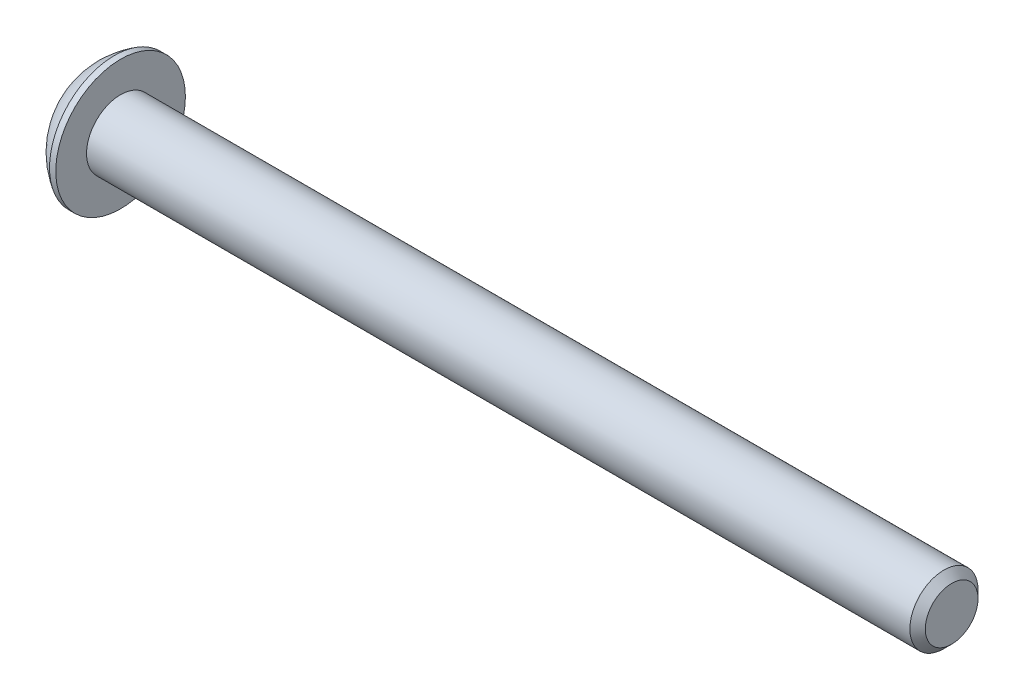
ISO-10303-21;
HEADER;
FILE_DESCRIPTION(('STEP AP214'),'2;1');
FILE_NAME('part.step','',(''),(''),'','','');
FILE_SCHEMA(('AUTOMOTIVE_DESIGN { 1 0 10303 214 1 1 1 1 }'));
ENDSEC;
DATA;
#1=APPLICATION_CONTEXT('core data for automotive mechanical design processes');
#2=APPLICATION_PROTOCOL_DEFINITION('international standard','automotive_design',2000,#1);
#3=PRODUCT_CONTEXT('',#1,'mechanical');
#4=PRODUCT('Part','Part','',(#3));
#5=PRODUCT_RELATED_PRODUCT_CATEGORY('part','',(#4));
#6=PRODUCT_DEFINITION_FORMATION('','',#4);
#7=PRODUCT_DEFINITION_CONTEXT('part definition',#1,'design');
#8=PRODUCT_DEFINITION('design','',#6,#7);
#9=PRODUCT_DEFINITION_SHAPE('','',#8);
#10=(LENGTH_UNIT() NAMED_UNIT(*) SI_UNIT(.MILLI.,.METRE.));
#11=(NAMED_UNIT(*) PLANE_ANGLE_UNIT() SI_UNIT($,.RADIAN.));
#12=(NAMED_UNIT(*) SI_UNIT($,.STERADIAN.) SOLID_ANGLE_UNIT());
#13=UNCERTAINTY_MEASURE_WITH_UNIT(LENGTH_MEASURE(1.E-05),#10,'distance_accuracy_value','');
#14=(GEOMETRIC_REPRESENTATION_CONTEXT(3) GLOBAL_UNCERTAINTY_ASSIGNED_CONTEXT((#13)) GLOBAL_UNIT_ASSIGNED_CONTEXT((#10,
#11,#12)) REPRESENTATION_CONTEXT('',''));
#15=CARTESIAN_POINT('',(0.,0.,0.));
#16=DIRECTION('',(0.,0.,1.));
#17=DIRECTION('',(1.,0.,0.));
#18=AXIS2_PLACEMENT_3D('',#15,#16,#17);
#19=CARTESIAN_POINT('',(1.32080000000034,0.,0.));
#20=DIRECTION('',(-1.,0.,0.));
#21=DIRECTION('',(0.,0.,-1.));
#22=AXIS2_PLACEMENT_3D('',#19,#20,#21);
#23=CONICAL_SURFACE('',#22,1.1937999999998,1.04719755119608);
#24=CARTESIAN_POINT('',(2.01004075135902,0.,-4.44089209850063E-13));
#25=VERTEX_POINT('',#24);
#26=VERTEX_LOOP('',#25);
#27=FACE_BOUND('',#26,.T.);
#28=CARTESIAN_POINT('',(1.32080000000009,0.,0.));
#29=DIRECTION('',(1.,0.,0.));
#30=DIRECTION('',(0.,0.,-1.));
#31=AXIS2_PLACEMENT_3D('',#28,#29,#30);
#32=CIRCLE('',#31,1.19380000000024);
#33=CARTESIAN_POINT('',(1.32080000000004,-1.03386112703797,-0.59690000000006));
#34=VERTEX_POINT('',#33);
#35=CARTESIAN_POINT('',(1.32080000000004,0.,-1.19380000000012));
#36=VERTEX_POINT('',#35);
#37=EDGE_CURVE('E37',#34,#36,#32,.T.);
#38=ORIENTED_EDGE('',*,*,#37,.F.);
#39=CARTESIAN_POINT('',(1.32080000000009,0.,0.));
#40=DIRECTION('',(1.,0.,0.));
#41=DIRECTION('',(0.,0.,-1.));
#42=AXIS2_PLACEMENT_3D('',#39,#40,#41);
#43=CIRCLE('',#42,1.19380000000024);
#44=CARTESIAN_POINT('',(1.32080000000004,-1.03386112703797,0.59690000000006));
#45=VERTEX_POINT('',#44);
#46=EDGE_CURVE('E127',#45,#34,#43,.T.);
#47=ORIENTED_EDGE('',*,*,#46,.F.);
#48=CARTESIAN_POINT('',(1.32080000000009,0.,0.));
#49=DIRECTION('',(1.,0.,0.));
#50=DIRECTION('',(0.,0.,-1.));
#51=AXIS2_PLACEMENT_3D('',#48,#49,#50);
#52=CIRCLE('',#51,1.19380000000024);
#53=CARTESIAN_POINT('',(1.32080000000004,1.49457637585666E-12,1.19380000000012));
#54=VERTEX_POINT('',#53);
#55=EDGE_CURVE('E133',#54,#45,#52,.T.);
#56=ORIENTED_EDGE('',*,*,#55,.F.);
#57=CARTESIAN_POINT('',(1.32080000000009,0.,0.));
#58=DIRECTION('',(1.,0.,0.));
#59=DIRECTION('',(0.,0.,-1.));
#60=AXIS2_PLACEMENT_3D('',#57,#58,#59);
#61=CIRCLE('',#60,1.19380000000024);
#62=CARTESIAN_POINT('',(1.32080000000004,1.03386112703797,0.596900000000061));
#63=VERTEX_POINT('',#62);
#64=EDGE_CURVE('E147',#63,#54,#61,.T.);
#65=ORIENTED_EDGE('',*,*,#64,.F.);
#66=CARTESIAN_POINT('',(1.32080000000009,0.,0.));
#67=DIRECTION('',(1.,0.,0.));
#68=DIRECTION('',(0.,0.,-1.));
#69=AXIS2_PLACEMENT_3D('',#66,#67,#68);
#70=CIRCLE('',#69,1.19380000000024);
#71=CARTESIAN_POINT('',(1.32080000000004,1.03386112703797,-0.596900000000061));
#72=VERTEX_POINT('',#71);
#73=EDGE_CURVE('E140',#72,#63,#70,.T.);
#74=ORIENTED_EDGE('',*,*,#73,.F.);
#75=CARTESIAN_POINT('',(1.32080000000009,0.,0.));
#76=DIRECTION('',(1.,0.,0.));
#77=DIRECTION('',(0.,0.,-1.));
#78=AXIS2_PLACEMENT_3D('',#75,#76,#77);
#79=CIRCLE('',#78,1.19380000000024);
#80=EDGE_CURVE('E137',#36,#72,#79,.T.);
#81=ORIENTED_EDGE('',*,*,#80,.F.);
#82=EDGE_LOOP('',(#38,#47,#56,#65,#74,#81));
#83=FACE_BOUND('',#82,.T.);
#84=ADVANCED_FACE('F34',(#27,#83),#23,.F.);
#85=CARTESIAN_POINT('',(1.3208,-2.06772225407572,1.1938));
#86=DIRECTION('',(1.,0.,0.));
#87=DIRECTION('',(0.,0.,1.));
#88=AXIS2_PLACEMENT_3D('',#85,#86,#87);
#89=PLANE('',#88);
#90=DIRECTION('',(0.,0.5,-0.866025403784439));
#91=VECTOR('',#90,1.);
#92=CARTESIAN_POINT('',(1.3208,-1.37848150271715,0.));
#93=LINE('',#92,#91);
#94=CARTESIAN_POINT('',(1.3208,-0.689240751358574,-1.1938));
#95=VERTEX_POINT('',#94);
#96=EDGE_CURVE('E109',#95,#34,#93,.F.);
#97=ORIENTED_EDGE('',*,*,#96,.T.);
#98=ORIENTED_EDGE('',*,*,#37,.T.);
#99=DIRECTION('',(0.,1.,0.));
#100=VECTOR('',#99,1.);
#101=CARTESIAN_POINT('',(1.3208,-0.689240751358574,-1.1938));
#102=LINE('',#101,#100);
#103=EDGE_CURVE('E124',#36,#95,#102,.F.);
#104=ORIENTED_EDGE('',*,*,#103,.T.);
#105=EDGE_LOOP('',(#97,#98,#104));
#106=FACE_BOUND('',#105,.T.);
#107=ADVANCED_FACE('F121',(#106),#89,.F.);
#108=CARTESIAN_POINT('',(1.3208,-2.06772225407572,1.1938));
#109=DIRECTION('',(1.,0.,0.));
#110=DIRECTION('',(0.,0.,1.));
#111=AXIS2_PLACEMENT_3D('',#108,#109,#110);
#112=PLANE('',#111);
#113=DIRECTION('',(0.,-0.5,-0.866025403784439));
#114=VECTOR('',#113,1.);
#115=CARTESIAN_POINT('',(1.3208,-0.689240751358574,1.1938));
#116=LINE('',#115,#114);
#117=CARTESIAN_POINT('',(1.3208,-1.37848150271715,0.));
#118=VERTEX_POINT('',#117);
#119=EDGE_CURVE('E129',#118,#45,#116,.F.);
#120=ORIENTED_EDGE('',*,*,#119,.T.);
#121=ORIENTED_EDGE('',*,*,#46,.T.);
#122=DIRECTION('',(0.,0.5,-0.866025403784439));
#123=VECTOR('',#122,1.);
#124=CARTESIAN_POINT('',(1.3208,-1.37848150271715,0.));
#125=LINE('',#124,#123);
#126=EDGE_CURVE('E104',#34,#118,#125,.F.);
#127=ORIENTED_EDGE('',*,*,#126,.T.);
#128=EDGE_LOOP('',(#120,#121,#127));
#129=FACE_BOUND('',#128,.T.);
#130=ADVANCED_FACE('F128',(#129),#112,.F.);
#131=CARTESIAN_POINT('',(1.3208,-2.06772225407572,1.1938));
#132=DIRECTION('',(1.,0.,0.));
#133=DIRECTION('',(0.,0.,1.));
#134=AXIS2_PLACEMENT_3D('',#131,#132,#133);
#135=PLANE('',#134);
#136=DIRECTION('',(0.,1.,0.));
#137=VECTOR('',#136,1.);
#138=CARTESIAN_POINT('',(1.3208,0.689240751358577,1.1938));
#139=LINE('',#138,#137);
#140=CARTESIAN_POINT('',(1.3208,-0.689240751358574,1.1938));
#141=VERTEX_POINT('',#140);
#142=EDGE_CURVE('E166',#141,#54,#139,.T.);
#143=ORIENTED_EDGE('',*,*,#142,.T.);
#144=ORIENTED_EDGE('',*,*,#55,.T.);
#145=DIRECTION('',(0.,-0.5,-0.866025403784439));
#146=VECTOR('',#145,1.);
#147=CARTESIAN_POINT('',(1.3208,-0.689240751358574,1.1938));
#148=LINE('',#147,#146);
#149=EDGE_CURVE('E164',#45,#141,#148,.F.);
#150=ORIENTED_EDGE('',*,*,#149,.T.);
#151=EDGE_LOOP('',(#143,#144,#150));
#152=FACE_BOUND('',#151,.T.);
#153=ADVANCED_FACE('F163',(#152),#135,.F.);
#154=CARTESIAN_POINT('',(1.3208,-2.06772225407572,1.1938));
#155=DIRECTION('',(1.,0.,0.));
#156=DIRECTION('',(0.,0.,1.));
#157=AXIS2_PLACEMENT_3D('',#154,#155,#156);
#158=PLANE('',#157);
#159=DIRECTION('',(0.,-0.5,0.866025403784439));
#160=VECTOR('',#159,1.);
#161=CARTESIAN_POINT('',(1.3208,1.37848150271715,0.));
#162=LINE('',#161,#160);
#163=CARTESIAN_POINT('',(1.3208,0.689240751358577,1.1938));
#164=VERTEX_POINT('',#163);
#165=EDGE_CURVE('E173',#164,#63,#162,.F.);
#166=ORIENTED_EDGE('',*,*,#165,.T.);
#167=ORIENTED_EDGE('',*,*,#64,.T.);
#168=DIRECTION('',(0.,1.,0.));
#169=VECTOR('',#168,1.);
#170=CARTESIAN_POINT('',(1.3208,0.689240751358577,1.1938));
#171=LINE('',#170,#169);
#172=EDGE_CURVE('E171',#54,#164,#171,.T.);
#173=ORIENTED_EDGE('',*,*,#172,.T.);
#174=EDGE_LOOP('',(#166,#167,#173));
#175=FACE_BOUND('',#174,.T.);
#176=ADVANCED_FACE('F170',(#175),#158,.F.);
#177=CARTESIAN_POINT('',(1.3208,-2.06772225407572,1.1938));
#178=DIRECTION('',(1.,0.,0.));
#179=DIRECTION('',(0.,0.,1.));
#180=AXIS2_PLACEMENT_3D('',#177,#178,#179);
#181=PLANE('',#180);
#182=DIRECTION('',(0.,0.5,0.866025403784439));
#183=VECTOR('',#182,1.);
#184=CARTESIAN_POINT('',(1.3208,0.689240751358576,-1.1938));
#185=LINE('',#184,#183);
#186=CARTESIAN_POINT('',(1.3208,1.37848150271715,0.));
#187=VERTEX_POINT('',#186);
#188=EDGE_CURVE('E184',#187,#72,#185,.F.);
#189=ORIENTED_EDGE('',*,*,#188,.T.);
#190=ORIENTED_EDGE('',*,*,#73,.T.);
#191=DIRECTION('',(0.,-0.5,0.866025403784439));
#192=VECTOR('',#191,1.);
#193=CARTESIAN_POINT('',(1.3208,1.37848150271715,0.));
#194=LINE('',#193,#192);
#195=EDGE_CURVE('E176',#63,#187,#194,.F.);
#196=ORIENTED_EDGE('',*,*,#195,.T.);
#197=EDGE_LOOP('',(#189,#190,#196));
#198=FACE_BOUND('',#197,.T.);
#199=ADVANCED_FACE('F182',(#198),#181,.F.);
#200=CARTESIAN_POINT('',(1.3208,-2.06772225407572,1.1938));
#201=DIRECTION('',(1.,0.,0.));
#202=DIRECTION('',(0.,0.,1.));
#203=AXIS2_PLACEMENT_3D('',#200,#201,#202);
#204=PLANE('',#203);
#205=DIRECTION('',(0.,1.,0.));
#206=VECTOR('',#205,1.);
#207=CARTESIAN_POINT('',(1.3208,-0.689240751358574,-1.1938));
#208=LINE('',#207,#206);
#209=CARTESIAN_POINT('',(1.3208,0.689240751358576,-1.1938));
#210=VERTEX_POINT('',#209);
#211=EDGE_CURVE('E144',#210,#36,#208,.F.);
#212=ORIENTED_EDGE('',*,*,#211,.T.);
#213=ORIENTED_EDGE('',*,*,#80,.T.);
#214=DIRECTION('',(0.,0.5,0.866025403784439));
#215=VECTOR('',#214,1.);
#216=CARTESIAN_POINT('',(1.3208,0.689240751358576,-1.1938));
#217=LINE('',#216,#215);
#218=EDGE_CURVE('E186',#72,#210,#217,.F.);
#219=ORIENTED_EDGE('',*,*,#218,.T.);
#220=EDGE_LOOP('',(#212,#213,#219));
#221=FACE_BOUND('',#220,.T.);
#222=ADVANCED_FACE('F307',(#221),#204,.F.);
#223=CARTESIAN_POINT('',(1.3208,-0.689240751358574,-1.1938));
#224=DIRECTION('',(0.,0.,1.));
#225=DIRECTION('',(0.,1.,0.));
#226=AXIS2_PLACEMENT_3D('',#223,#224,#225);
#227=PLANE('',#226);
#228=DIRECTION('',(0.,1.,0.));
#229=VECTOR('',#228,1.);
#230=CARTESIAN_POINT('',(0.,0.,-1.1938));
#231=LINE('',#230,#229);
#232=CARTESIAN_POINT('',(0.,0.689240751358577,-1.1938));
#233=VERTEX_POINT('',#232);
#234=CARTESIAN_POINT('',(0.,-0.689240751358574,-1.1938));
#235=VERTEX_POINT('',#234);
#236=EDGE_CURVE('E194',#233,#235,#231,.F.);
#237=ORIENTED_EDGE('',*,*,#236,.T.);
#238=DIRECTION('',(1.,0.,0.));
#239=VECTOR('',#238,1.);
#240=CARTESIAN_POINT('',(1.3208,-0.689240751358574,-1.1938));
#241=LINE('',#240,#239);
#242=EDGE_CURVE('E116',#235,#95,#241,.T.);
#243=ORIENTED_EDGE('',*,*,#242,.T.);
#244=ORIENTED_EDGE('',*,*,#103,.F.);
#245=ORIENTED_EDGE('',*,*,#211,.F.);
#246=DIRECTION('',(1.,0.,0.));
#247=VECTOR('',#246,1.);
#248=CARTESIAN_POINT('',(1.3208,0.689240751358576,-1.1938));
#249=LINE('',#248,#247);
#250=EDGE_CURVE('E189',#210,#233,#249,.F.);
#251=ORIENTED_EDGE('',*,*,#250,.T.);
#252=EDGE_LOOP('',(#237,#243,#244,#245,#251));
#253=FACE_BOUND('',#252,.T.);
#254=ADVANCED_FACE('F273',(#253),#227,.T.);
#255=CARTESIAN_POINT('',(1.3208,-1.37848150271715,0.));
#256=DIRECTION('',(0.,0.866025403784439,0.5));
#257=DIRECTION('',(0.,0.5,-0.866025403784439));
#258=AXIS2_PLACEMENT_3D('',#255,#256,#257);
#259=PLANE('',#258);
#260=DIRECTION('',(0.,-0.5,0.866025403784439));
#261=VECTOR('',#260,1.);
#262=CARTESIAN_POINT('',(0.,-0.689240751358574,-1.1938));
#263=LINE('',#262,#261);
#264=CARTESIAN_POINT('',(0.,-1.37848150271715,0.));
#265=VERTEX_POINT('',#264);
#266=EDGE_CURVE('E270',#235,#265,#263,.T.);
#267=ORIENTED_EDGE('',*,*,#266,.T.);
#268=DIRECTION('',(1.,0.,0.));
#269=VECTOR('',#268,1.);
#270=CARTESIAN_POINT('',(1.3208,-1.37848150271715,0.));
#271=LINE('',#270,#269);
#272=EDGE_CURVE('E111',#265,#118,#271,.T.);
#273=ORIENTED_EDGE('',*,*,#272,.T.);
#274=ORIENTED_EDGE('',*,*,#126,.F.);
#275=ORIENTED_EDGE('',*,*,#96,.F.);
#276=ORIENTED_EDGE('',*,*,#242,.F.);
#277=EDGE_LOOP('',(#267,#273,#274,#275,#276));
#278=FACE_BOUND('',#277,.T.);
#279=ADVANCED_FACE('F107',(#278),#259,.T.);
#280=CARTESIAN_POINT('',(1.3208,-0.689240751358574,1.1938));
#281=DIRECTION('',(0.,0.866025403784439,-0.5));
#282=DIRECTION('',(0.,-0.5,-0.866025403784439));
#283=AXIS2_PLACEMENT_3D('',#280,#281,#282);
#284=PLANE('',#283);
#285=DIRECTION('',(0.,0.5,0.866025403784439));
#286=VECTOR('',#285,1.);
#287=CARTESIAN_POINT('',(0.,-1.37848150271715,0.));
#288=LINE('',#287,#286);
#289=CARTESIAN_POINT('',(0.,-0.689240751358574,1.1938));
#290=VERTEX_POINT('',#289);
#291=EDGE_CURVE('E268',#265,#290,#288,.T.);
#292=ORIENTED_EDGE('',*,*,#291,.T.);
#293=DIRECTION('',(1.,0.,0.));
#294=VECTOR('',#293,1.);
#295=CARTESIAN_POINT('',(1.3208,-0.689240751358574,1.1938));
#296=LINE('',#295,#294);
#297=EDGE_CURVE('E177',#290,#141,#296,.T.);
#298=ORIENTED_EDGE('',*,*,#297,.T.);
#299=ORIENTED_EDGE('',*,*,#149,.F.);
#300=ORIENTED_EDGE('',*,*,#119,.F.);
#301=ORIENTED_EDGE('',*,*,#272,.F.);
#302=EDGE_LOOP('',(#292,#298,#299,#300,#301));
#303=FACE_BOUND('',#302,.T.);
#304=ADVANCED_FACE('F278',(#303),#284,.T.);
#305=CARTESIAN_POINT('',(1.3208,0.689240751358577,1.1938));
#306=DIRECTION('',(0.,0.,-1.));
#307=DIRECTION('',(1.,0.,0.));
#308=AXIS2_PLACEMENT_3D('',#305,#306,#307);
#309=PLANE('',#308);
#310=DIRECTION('',(0.,1.,0.));
#311=VECTOR('',#310,1.);
#312=CARTESIAN_POINT('',(0.,0.,1.1938));
#313=LINE('',#312,#311);
#314=CARTESIAN_POINT('',(0.,0.689240751358577,1.1938));
#315=VERTEX_POINT('',#314);
#316=EDGE_CURVE('E260',#290,#315,#313,.T.);
#317=ORIENTED_EDGE('',*,*,#316,.T.);
#318=DIRECTION('',(1.,0.,0.));
#319=VECTOR('',#318,1.);
#320=CARTESIAN_POINT('',(1.3208,0.689240751358577,1.1938));
#321=LINE('',#320,#319);
#322=EDGE_CURVE('E187',#315,#164,#321,.T.);
#323=ORIENTED_EDGE('',*,*,#322,.T.);
#324=ORIENTED_EDGE('',*,*,#172,.F.);
#325=ORIENTED_EDGE('',*,*,#142,.F.);
#326=ORIENTED_EDGE('',*,*,#297,.F.);
#327=EDGE_LOOP('',(#317,#323,#324,#325,#326));
#328=FACE_BOUND('',#327,.T.);
#329=ADVANCED_FACE('F280',(#328),#309,.T.);
#330=CARTESIAN_POINT('',(1.3208,1.37848150271715,0.));
#331=DIRECTION('',(0.,-0.866025403784439,-0.5));
#332=DIRECTION('',(0.,-0.5,0.866025403784439));
#333=AXIS2_PLACEMENT_3D('',#330,#331,#332);
#334=PLANE('',#333);
#335=DIRECTION('',(0.,0.5,-0.866025403784439));
#336=VECTOR('',#335,1.);
#337=CARTESIAN_POINT('',(0.,0.689240751358577,1.1938));
#338=LINE('',#337,#336);
#339=CARTESIAN_POINT('',(0.,1.37848150271715,0.));
#340=VERTEX_POINT('',#339);
#341=EDGE_CURVE('E257',#315,#340,#338,.T.);
#342=ORIENTED_EDGE('',*,*,#341,.T.);
#343=DIRECTION('',(1.,0.,0.));
#344=VECTOR('',#343,1.);
#345=CARTESIAN_POINT('',(1.3208,1.37848150271715,0.));
#346=LINE('',#345,#344);
#347=EDGE_CURVE('E202',#340,#187,#346,.T.);
#348=ORIENTED_EDGE('',*,*,#347,.T.);
#349=ORIENTED_EDGE('',*,*,#195,.F.);
#350=ORIENTED_EDGE('',*,*,#165,.F.);
#351=ORIENTED_EDGE('',*,*,#322,.F.);
#352=EDGE_LOOP('',(#342,#348,#349,#350,#351));
#353=FACE_BOUND('',#352,.T.);
#354=ADVANCED_FACE('F281',(#353),#334,.T.);
#355=CARTESIAN_POINT('',(1.3208,0.689240751358576,-1.1938));
#356=DIRECTION('',(0.,-0.866025403784439,0.5));
#357=DIRECTION('',(0.,0.5,0.866025403784439));
#358=AXIS2_PLACEMENT_3D('',#355,#356,#357);
#359=PLANE('',#358);
#360=DIRECTION('',(0.,-0.5,-0.866025403784439));
#361=VECTOR('',#360,1.);
#362=CARTESIAN_POINT('',(0.,1.37848150271715,0.));
#363=LINE('',#362,#361);
#364=EDGE_CURVE('E52',#340,#233,#363,.T.);
#365=ORIENTED_EDGE('',*,*,#364,.T.);
#366=ORIENTED_EDGE('',*,*,#250,.F.);
#367=ORIENTED_EDGE('',*,*,#218,.F.);
#368=ORIENTED_EDGE('',*,*,#188,.F.);
#369=ORIENTED_EDGE('',*,*,#347,.F.);
#370=EDGE_LOOP('',(#365,#366,#367,#368,#369));
#371=FACE_BOUND('',#370,.T.);
#372=ADVANCED_FACE('F282',(#371),#359,.T.);
#373=CARTESIAN_POINT('',(0.,0.,0.));
#374=DIRECTION('',(-1.,0.,0.));
#375=DIRECTION('',(0.,0.,-1.));
#376=AXIS2_PLACEMENT_3D('',#373,#374,#375);
#377=PLANE('',#376);
#378=ORIENTED_EDGE('',*,*,#341,.F.);
#379=ORIENTED_EDGE('',*,*,#316,.F.);
#380=ORIENTED_EDGE('',*,*,#291,.F.);
#381=ORIENTED_EDGE('',*,*,#266,.F.);
#382=ORIENTED_EDGE('',*,*,#236,.F.);
#383=ORIENTED_EDGE('',*,*,#364,.F.);
#384=EDGE_LOOP('',(#378,#379,#380,#381,#382,#383));
#385=FACE_BOUND('',#384,.T.);
#386=CARTESIAN_POINT('',(0.,1.9812,0.));
#387=CARTESIAN_POINT('',(0.,1.9811996664299,-0.0556258831179428));
#388=CARTESIAN_POINT('',(0.,1.97885520380442,-0.111261989398606));
#389=CARTESIAN_POINT('',(0.,1.96949260169541,-0.222149719830458));
#390=CARTESIAN_POINT('',(0.,1.96247308239605,-0.277401225602895));
#391=CARTESIAN_POINT('',(0.,1.94379192841038,-0.387209508139747));
#392=CARTESIAN_POINT('',(-1.85325793235264E-13,1.93212292489526,-0.441765039546365));
#393=CARTESIAN_POINT('',(1.86344214223505E-13,1.90422331175315,-0.549729449347493));
#394=CARTESIAN_POINT('',(6.94543371897454E-13,1.88798900035338,-0.603137359208869));
#395=CARTESIAN_POINT('',(1.15501975216981E-12,1.83266214476501,-0.760839131321828));
#396=CARTESIAN_POINT('',(0.,1.78690023648845,-0.862876433575429));
#397=CARTESIAN_POINT('',(0.,1.67887358150667,-1.05780719540872));
#398=CARTESIAN_POINT('',(9.54193214892627E-13,1.6166082074585,-1.15070030720801));
#399=CARTESIAN_POINT('',(5.94805591894675E-13,1.51224157140982,-1.28116890915697));
#400=CARTESIAN_POINT('',(1.63221293851378E-13,1.4755970394354,-1.32320451127026));
#401=CARTESIAN_POINT('',(-1.62196980336157E-13,1.39893832619713,-1.40400288695709));
#402=CARTESIAN_POINT('',(0.,1.35892742784698,-1.44276877695455));
#403=CARTESIAN_POINT('',(1.14362537325405E-13,1.23416504602197,-1.55382272417904));
#404=CARTESIAN_POINT('',(0.,1.14466125559859,-1.62089527952111));
#405=CARTESIAN_POINT('',(0.,0.955712144178167,-1.7390221808118));
#406=CARTESIAN_POINT('',(0.,0.856267198233564,-1.79007713076007));
#407=CARTESIAN_POINT('',(0.,0.650206345910843,-1.87477637530954));
#408=CARTESIAN_POINT('',(0.,0.543590516134855,-1.90842085586267));
#409=CARTESIAN_POINT('',(0.,0.326226155292018,-1.95733039300656));
#410=CARTESIAN_POINT('',(0.,0.21547760215793,-1.97259535144288));
#411=CARTESIAN_POINT('',(0.,-0.00701040587544633,-1.98431697865418));
#412=CARTESIAN_POINT('',(0.,-0.118749860774734,-1.98077364742917));
#413=CARTESIAN_POINT('',(0.,-0.340050178355485,-1.95497485623825));
#414=CARTESIAN_POINT('',(0.,-0.449611052668256,-1.93271949620218));
#415=CARTESIAN_POINT('',(0.,-0.663431110729174,-1.87014138774524));
#416=CARTESIAN_POINT('',(0.,-0.76769023783852,-1.82981844635272));
#417=CARTESIAN_POINT('',(0.,-0.968005760719347,-1.73219968377096));
#418=CARTESIAN_POINT('',(0.,-1.0640618469811,-1.6749032225164));
#419=CARTESIAN_POINT('',(0.,-1.19980276751283,-1.57757371205873));
#420=CARTESIAN_POINT('',(0.,-1.24366557129213,-1.54322665019466));
#421=CARTESIAN_POINT('',(0.,-1.32838995706696,-1.47093063174264));
#422=CARTESIAN_POINT('',(0.,-1.36924860178706,-1.43297823102439));
#423=CARTESIAN_POINT('',(0.,-1.48674671849223,-1.31419842051173));
#424=CARTESIAN_POINT('',(0.,-1.55842832343237,-1.22836221289311));
#425=CARTESIAN_POINT('',(0.,-1.6863396856475,-1.04586168272493));
#426=CARTESIAN_POINT('',(0.,-1.7425700302488,-0.949197771949775));
#427=CARTESIAN_POINT('',(0.,-1.8141614250401,-0.798182600298684));
#428=CARTESIAN_POINT('',(0.,-1.83591780585875,-0.74677620384779));
#429=CARTESIAN_POINT('',(0.,-1.87500754181092,-0.642341081688635));
#430=CARTESIAN_POINT('',(0.,-1.89234447645404,-0.589313708122846));
#431=CARTESIAN_POINT('',(0.,-1.92246053433555,-0.482076273028395));
#432=CARTESIAN_POINT('',(0.,-1.93524685475118,-0.42786822425751));
#433=CARTESIAN_POINT('',(0.,-1.95620937250494,-0.318578151844611));
#434=CARTESIAN_POINT('',(0.,-1.96438692958147,-0.263496390912872));
#435=CARTESIAN_POINT('',(0.,-1.97388528284653,-0.173607715038558));
#436=CARTESIAN_POINT('',(0.,-1.97662743364426,-0.138944718024998));
#437=CARTESIAN_POINT('',(0.,-1.98028489645283,-0.0695224782567002));
#438=CARTESIAN_POINT('',(0.,-1.98120020846367,-0.0347632355019631));
#439=CARTESIAN_POINT('',(0.,-1.9811996664299,0.0556258831179437));
#440=CARTESIAN_POINT('',(0.,-1.97885520380442,0.111261989398607));
#441=CARTESIAN_POINT('',(0.,-1.96949260169541,0.222149719830459));
#442=CARTESIAN_POINT('',(0.,-1.96247308239606,0.277401225602897));
#443=CARTESIAN_POINT('',(0.,-1.94379192841039,0.38720950813975));
#444=CARTESIAN_POINT('',(-1.85269749640692E-13,-1.93212292489526,0.441765039546367));
#445=CARTESIAN_POINT('',(1.86288125054388E-13,-1.90422331175315,0.549729449347495));
#446=CARTESIAN_POINT('',(6.94525090263764E-13,-1.88798900035338,0.603137359208872));
#447=CARTESIAN_POINT('',(1.15505622829081E-12,-1.83266214476501,0.760839131321831));
#448=CARTESIAN_POINT('',(0.,-1.78690023648845,0.862876433575431));
#449=CARTESIAN_POINT('',(0.,-1.67887358150667,1.05780719540872));
#450=CARTESIAN_POINT('',(9.5424881286938E-13,-1.6166082074585,1.15070030720801));
#451=CARTESIAN_POINT('',(5.94777756479239E-13,-1.51224157140982,1.28116890915698));
#452=CARTESIAN_POINT('',(1.63138949183833E-13,-1.47559703943539,1.32320451127027));
#453=CARTESIAN_POINT('',(-1.62114715061273E-13,-1.39893832619713,1.40400288695709));
#454=CARTESIAN_POINT('',(0.,-1.35892742784699,1.44276877695455));
#455=CARTESIAN_POINT('',(1.13760489124207E-13,-1.23416504602197,1.55382272417904));
#456=CARTESIAN_POINT('',(0.,-1.14466125559859,1.62089527952111));
#457=CARTESIAN_POINT('',(0.,-0.95571214417816,1.73902218081179));
#458=CARTESIAN_POINT('',(0.,-0.856267198233559,1.79007713076007));
#459=CARTESIAN_POINT('',(0.,-0.65020634591084,1.87477637530954));
#460=CARTESIAN_POINT('',(0.,-0.543590516134854,1.90842085586267));
#461=CARTESIAN_POINT('',(0.,-0.326226155292018,1.95733039300657));
#462=CARTESIAN_POINT('',(0.,-0.215477602157929,1.97259535144288));
#463=CARTESIAN_POINT('',(0.,0.00701040587544865,1.98431697865418));
#464=CARTESIAN_POINT('',(0.,0.118749860774737,1.98077364742916));
#465=CARTESIAN_POINT('',(0.,0.340050178355489,1.95497485623824));
#466=CARTESIAN_POINT('',(0.,0.44961105266826,1.93271949620218));
#467=CARTESIAN_POINT('',(0.,0.663431110729178,1.87014138774524));
#468=CARTESIAN_POINT('',(0.,0.767690237838524,1.82981844635272));
#469=CARTESIAN_POINT('',(0.,0.968005760719347,1.73219968377096));
#470=CARTESIAN_POINT('',(0.,1.0640618469811,1.67490322251639));
#471=CARTESIAN_POINT('',(0.,1.19980276751283,1.57757371205873));
#472=CARTESIAN_POINT('',(0.,1.24366557129214,1.54322665019465));
#473=CARTESIAN_POINT('',(0.,1.32838995706696,1.47093063174263));
#474=CARTESIAN_POINT('',(0.,1.36924860178706,1.43297823102439));
#475=CARTESIAN_POINT('',(0.,1.48674671849223,1.31419842051172));
#476=CARTESIAN_POINT('',(0.,1.55842832343237,1.22836221289311));
#477=CARTESIAN_POINT('',(0.,1.6863396856475,1.04586168272492));
#478=CARTESIAN_POINT('',(0.,1.7425700302488,0.949197771949768));
#479=CARTESIAN_POINT('',(0.,1.8141614250401,0.798182600298677));
#480=CARTESIAN_POINT('',(0.,1.83591780585875,0.746776203847785));
#481=CARTESIAN_POINT('',(0.,1.87500754181092,0.64234108168863));
#482=CARTESIAN_POINT('',(0.,1.89234447645404,0.589313708122841));
#483=CARTESIAN_POINT('',(0.,1.92246053433555,0.482076273028389));
#484=CARTESIAN_POINT('',(0.,1.93524685475118,0.427868224257504));
#485=CARTESIAN_POINT('',(0.,1.95620937250494,0.318578151844605));
#486=CARTESIAN_POINT('',(0.,1.96438692958147,0.263496390912866));
#487=CARTESIAN_POINT('',(0.,1.97388528284653,0.173607715038553));
#488=CARTESIAN_POINT('',(0.,1.97662743364426,0.138944718024994));
#489=CARTESIAN_POINT('',(0.,1.98028489645283,0.0695224782566989));
#490=CARTESIAN_POINT('',(0.,1.98120020846367,0.034763235501963));
#491=CARTESIAN_POINT('',(0.,1.9812,0.));
#492=B_SPLINE_CURVE_WITH_KNOTS('',3,(#386,#387,#388,#389,#390,#391,#392,#393,#394,#395,#396,
#397,#398,#399,#400,#401,#402,#403,#404,#405,#406,#407,#408,#409,#410,#411,#412,#413,#414,#415,
#416,#417,#418,#419,#420,#421,#422,#423,#424,#425,#426,#427,#428,#429,#430,#431,#432,#433,#434,
#435,#436,#437,#438,#439,#440,#441,#442,#443,#444,#445,#446,#447,#448,#449,#450,#451,#452,#453,
#454,#455,#456,#457,#458,#459,#460,#461,#462,#463,#464,#465,#466,#467,#468,#469,#470,#471,#472,
#473,#474,#475,#476,#477,#478,#479,#480,#481,#482,#483,#484,#485,#486,#487,#488,#489,#490,#491),
.UNSPECIFIED.,.T.,.F.,(4,2,2,2,2,2,2,2,2,2,2,2,2,2,2,2,2,2,2,2,2,2,2,2,2,2,2,2,2,2,2,2,2,2,2,2,
2,2,2,2,2,2,2,2,2,2,2,2,2,2,2,2,4),(0.,0.166845646007828,0.333740557374255,0.500901034367693,
0.668197445942386,1.00199278686282,1.33580081809885,1.50292354032982,1.6698851310853,
2.00370118900129,2.33750465770544,2.67130456115909,3.00510624723801,3.33890793331696,
3.67270783677065,4.00651130547476,4.34032736339026,4.50728895414554,4.67441167637632,
5.00821970761259,5.34201504853332,5.50931146010827,5.67647193710191,5.84336684846844,
6.0102124944764,6.11448220058334,6.21875190669029,6.38559755269812,6.55249246406454,
6.71965294105798,6.88694935263268,7.22074469355311,7.55455272478915,7.72167544702011,
7.88863703777559,8.22245309569158,8.55625656439573,8.89005646784938,9.2238581539283,
9.55765984000725,9.89145974346094,10.2252632121651,10.5590792700806,10.7260408608358,
10.8931635830666,11.2269716143029,11.5607669552236,11.7280633667986,11.8952238437922,
12.0621187551587,12.2289644011667,12.3332341072736,12.4375038133806),.UNSPECIFIED.);
#493=CARTESIAN_POINT('',(0.,1.9812,0.));
#494=VERTEX_POINT('',#493);
#495=EDGE_CURVE('E150',#494,#494,#492,.T.);
#496=ORIENTED_EDGE('',*,*,#495,.T.);
#497=EDGE_LOOP('',(#496));
#498=FACE_BOUND('',#497,.T.);
#499=ADVANCED_FACE('F275',(#385,#498),#377,.T.);
#500=CARTESIAN_POINT('',(4.13385,0.,0.));
#501=DIRECTION('',(0.,1.,0.));
#502=DIRECTION('',(1.,0.,0.));
#503=AXIS2_PLACEMENT_3D('',#500,#501,#502);
#504=SPHERICAL_SURFACE('',#503,4.58408870578439);
#505=CARTESIAN_POINT('',(1.8288,0.,0.));
#506=DIRECTION('',(1.,0.,0.));
#507=DIRECTION('',(0.,0.,-1.));
#508=AXIS2_PLACEMENT_3D('',#505,#506,#507);
#509=CIRCLE('',#508,3.9624);
#510=CARTESIAN_POINT('',(1.8288,0.,-3.9624));
#511=VERTEX_POINT('',#510);
#512=EDGE_CURVE('E250',#511,#511,#509,.F.);
#513=ORIENTED_EDGE('',*,*,#512,.T.);
#514=EDGE_LOOP('',(#513));
#515=FACE_BOUND('',#514,.T.);
#516=ORIENTED_EDGE('',*,*,#495,.F.);
#517=EDGE_LOOP('',(#516));
#518=FACE_BOUND('',#517,.T.);
#519=ADVANCED_FACE('F289',(#515,#518),#504,.T.);
#520=CARTESIAN_POINT('',(53.0098,0.,0.));
#521=DIRECTION('',(-1.,0.,0.));
#522=DIRECTION('',(0.,0.,-1.));
#523=AXIS2_PLACEMENT_3D('',#520,#521,#522);
#524=PLANE('',#523);
#525=CARTESIAN_POINT('',(53.0097999999839,0.,0.));
#526=DIRECTION('',(1.,0.,0.));
#527=DIRECTION('',(0.,0.,-1.));
#528=AXIS2_PLACEMENT_3D('',#525,#526,#527);
#529=CIRCLE('',#528,1.61036000002923);
#530=CARTESIAN_POINT('',(53.0097999999839,0.,-1.61036000002923));
#531=VERTEX_POINT('',#530);
#532=EDGE_CURVE('E248',#531,#531,#529,.T.);
#533=ORIENTED_EDGE('',*,*,#532,.T.);
#534=EDGE_LOOP('',(#533));
#535=FACE_BOUND('',#534,.T.);
#536=ADVANCED_FACE('F346',(#535),#524,.F.);
#537=CARTESIAN_POINT('',(0.,0.,0.));
#538=DIRECTION('',(-1.,0.,0.));
#539=DIRECTION('',(0.,0.,-1.));
#540=AXIS2_PLACEMENT_3D('',#537,#538,#539);
#541=CYLINDRICAL_SURFACE('',#540,3.9624);
#542=ORIENTED_EDGE('',*,*,#512,.F.);
#543=EDGE_LOOP('',(#542));
#544=FACE_BOUND('',#543,.T.);
#545=CARTESIAN_POINT('',(2.2098,0.,0.));
#546=DIRECTION('',(1.,0.,0.));
#547=DIRECTION('',(0.,0.,-1.));
#548=AXIS2_PLACEMENT_3D('',#545,#546,#547);
#549=CIRCLE('',#548,3.9624);
#550=CARTESIAN_POINT('',(2.2098,0.,-3.9624));
#551=VERTEX_POINT('',#550);
#552=EDGE_CURVE('E245',#551,#551,#549,.T.);
#553=ORIENTED_EDGE('',*,*,#552,.F.);
#554=EDGE_LOOP('',(#553));
#555=FACE_BOUND('',#554,.T.);
#556=ADVANCED_FACE('F354',(#544,#555),#541,.T.);
#557=CARTESIAN_POINT('',(52.5373600000307,0.,0.));
#558=DIRECTION('',(-1.,0.,0.));
#559=DIRECTION('',(0.,0.,-1.));
#560=AXIS2_PLACEMENT_3D('',#557,#558,#559);
#561=CONICAL_SURFACE('',#560,2.08279999992556,0.785398163337289);
#562=ORIENTED_EDGE('',*,*,#532,.F.);
#563=EDGE_LOOP('',(#562));
#564=FACE_BOUND('',#563,.T.);
#565=CARTESIAN_POINT('',(52.53736,0.,0.));
#566=DIRECTION('',(1.,0.,0.));
#567=DIRECTION('',(0.,0.,-1.));
#568=AXIS2_PLACEMENT_3D('',#565,#566,#567);
#569=CIRCLE('',#568,2.0828);
#570=CARTESIAN_POINT('',(52.53736,0.,-2.0828));
#571=VERTEX_POINT('',#570);
#572=EDGE_CURVE('E43',#571,#571,#569,.T.);
#573=ORIENTED_EDGE('',*,*,#572,.T.);
#574=EDGE_LOOP('',(#573));
#575=FACE_BOUND('',#574,.T.);
#576=ADVANCED_FACE('F364',(#564,#575),#561,.T.);
#577=CARTESIAN_POINT('',(2.2098,2.0828,0.));
#578=DIRECTION('',(-1.,0.,0.));
#579=DIRECTION('',(0.,0.,-1.));
#580=AXIS2_PLACEMENT_3D('',#577,#578,#579);
#581=PLANE('',#580);
#582=CARTESIAN_POINT('',(2.2098,0.,0.));
#583=DIRECTION('',(1.,0.,0.));
#584=DIRECTION('',(0.,0.,-1.));
#585=AXIS2_PLACEMENT_3D('',#582,#583,#584);
#586=CIRCLE('',#585,2.0828);
#587=CARTESIAN_POINT('',(2.2098,0.,-2.0828));
#588=VERTEX_POINT('',#587);
#589=EDGE_CURVE('E11',#588,#588,#586,.F.);
#590=ORIENTED_EDGE('',*,*,#589,.T.);
#591=EDGE_LOOP('',(#590));
#592=FACE_BOUND('',#591,.T.);
#593=ORIENTED_EDGE('',*,*,#552,.T.);
#594=EDGE_LOOP('',(#593));
#595=FACE_BOUND('',#594,.T.);
#596=ADVANCED_FACE('F374',(#592,#595),#581,.F.);
#597=CARTESIAN_POINT('',(0.,0.,0.));
#598=DIRECTION('',(-1.,0.,0.));
#599=DIRECTION('',(0.,0.,-1.));
#600=AXIS2_PLACEMENT_3D('',#597,#598,#599);
#601=CYLINDRICAL_SURFACE('',#600,2.0828);
#602=ORIENTED_EDGE('',*,*,#572,.F.);
#603=EDGE_LOOP('',(#602));
#604=FACE_BOUND('',#603,.T.);
#605=ORIENTED_EDGE('',*,*,#589,.F.);
#606=EDGE_LOOP('',(#605));
#607=FACE_BOUND('',#606,.T.);
#608=ADVANCED_FACE('F384',(#604,#607),#601,.T.);
#609=CLOSED_SHELL('',(#84,#107,#130,#153,#176,#199,#222,#254,#279,#304,#329,#354,#372,#499,#519,
#536,#556,#576,#596,#608));
#610=MANIFOLD_SOLID_BREP('B2',#609);
#611=ADVANCED_BREP_SHAPE_REPRESENTATION('',(#18,#610),#14);
#612=SHAPE_DEFINITION_REPRESENTATION(#9,#611);
ENDSEC;
END-ISO-10303-21;
